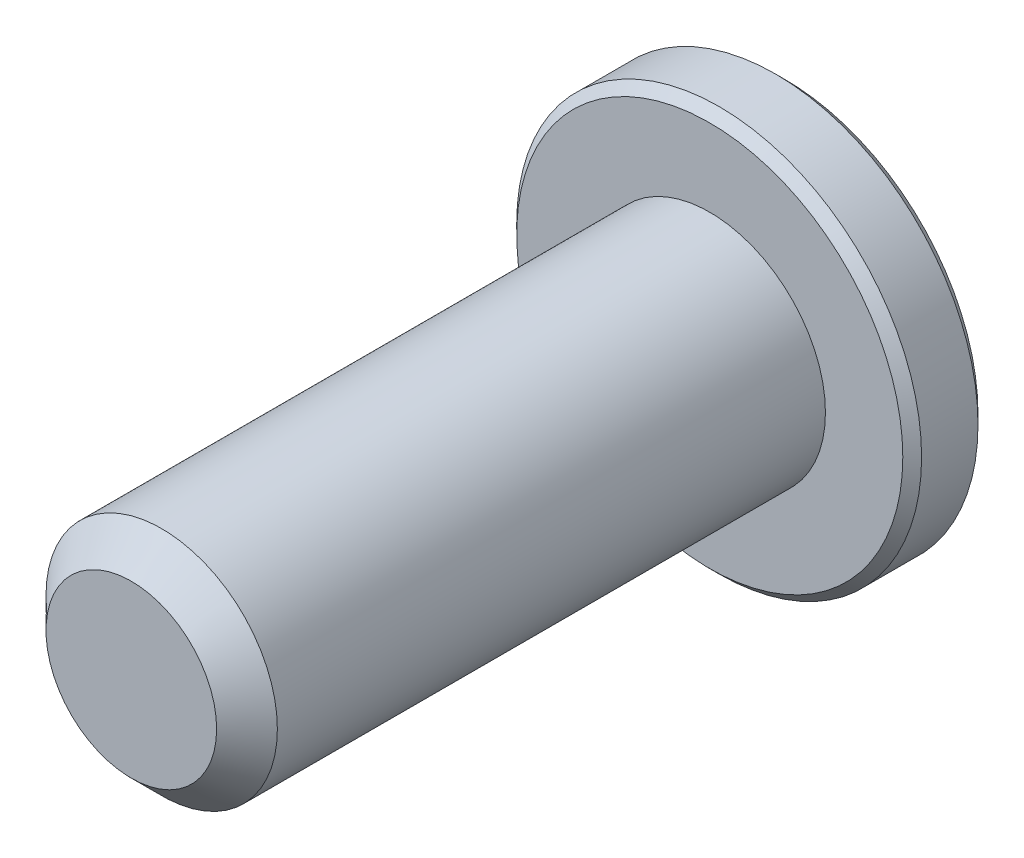
ISO-10303-21;
HEADER;
FILE_DESCRIPTION(('STEP AP214'),'2;1');
FILE_NAME('part.step','',(''),(''),'','','');
FILE_SCHEMA(('AUTOMOTIVE_DESIGN { 1 0 10303 214 1 1 1 1 }'));
ENDSEC;
DATA;
#1=APPLICATION_CONTEXT('core data for automotive mechanical design processes');
#2=APPLICATION_PROTOCOL_DEFINITION('international standard','automotive_design',2000,#1);
#3=PRODUCT_CONTEXT('',#1,'mechanical');
#4=PRODUCT('Part','Part','',(#3));
#5=PRODUCT_RELATED_PRODUCT_CATEGORY('part','',(#4));
#6=PRODUCT_DEFINITION_FORMATION('','',#4);
#7=PRODUCT_DEFINITION_CONTEXT('part definition',#1,'design');
#8=PRODUCT_DEFINITION('design','',#6,#7);
#9=PRODUCT_DEFINITION_SHAPE('','',#8);
#10=(LENGTH_UNIT() NAMED_UNIT(*) SI_UNIT(.MILLI.,.METRE.));
#11=(NAMED_UNIT(*) PLANE_ANGLE_UNIT() SI_UNIT($,.RADIAN.));
#12=(NAMED_UNIT(*) SI_UNIT($,.STERADIAN.) SOLID_ANGLE_UNIT());
#13=UNCERTAINTY_MEASURE_WITH_UNIT(LENGTH_MEASURE(1.E-05),#10,'distance_accuracy_value','');
#14=(GEOMETRIC_REPRESENTATION_CONTEXT(3) GLOBAL_UNCERTAINTY_ASSIGNED_CONTEXT((#13)) GLOBAL_UNIT_ASSIGNED_CONTEXT((#10,
#11,#12)) REPRESENTATION_CONTEXT('',''));
#15=CARTESIAN_POINT('',(0.,0.,0.));
#16=DIRECTION('',(0.,0.,1.));
#17=DIRECTION('',(1.,0.,0.));
#18=AXIS2_PLACEMENT_3D('',#15,#16,#17);
#19=CARTESIAN_POINT('',(0.,0.,-5.65));
#20=DIRECTION('',(0.,0.,1.));
#21=DIRECTION('',(1.,0.,0.));
#22=AXIS2_PLACEMENT_3D('',#19,#20,#21);
#23=PLANE('',#22);
#24=CARTESIAN_POINT('',(0.,0.,-5.65));
#25=DIRECTION('',(0.,0.,1.));
#26=DIRECTION('',(1.,0.,0.));
#27=AXIS2_PLACEMENT_3D('',#24,#25,#26);
#28=CIRCLE('',#27,3.3375);
#29=CARTESIAN_POINT('',(3.3375,0.,-5.65));
#30=VERTEX_POINT('',#29);
#31=EDGE_CURVE('E143',#30,#30,#28,.F.);
#32=ORIENTED_EDGE('',*,*,#31,.T.);
#33=EDGE_LOOP('',(#32));
#34=FACE_BOUND('',#33,.T.);
#35=CARTESIAN_POINT('',(0.,0.,-5.65));
#36=DIRECTION('',(0.,0.,1.));
#37=DIRECTION('',(1.,0.,0.));
#38=AXIS2_PLACEMENT_3D('',#35,#36,#37);
#39=CIRCLE('',#38,1.44337567297406);
#40=CARTESIAN_POINT('',(1.25,0.721687836487034,-5.65));
#41=VERTEX_POINT('',#40);
#42=CARTESIAN_POINT('',(0.,1.44337567297406,-5.65));
#43=VERTEX_POINT('',#42);
#44=EDGE_CURVE('E92',#41,#43,#39,.T.);
#45=ORIENTED_EDGE('',*,*,#44,.T.);
#46=CARTESIAN_POINT('',(0.,0.,-5.65));
#47=DIRECTION('',(0.,0.,1.));
#48=DIRECTION('',(1.,0.,0.));
#49=AXIS2_PLACEMENT_3D('',#46,#47,#48);
#50=CIRCLE('',#49,1.44337567297406);
#51=CARTESIAN_POINT('',(-1.25,0.721687836487028,-5.65));
#52=VERTEX_POINT('',#51);
#53=EDGE_CURVE('E103',#43,#52,#50,.T.);
#54=ORIENTED_EDGE('',*,*,#53,.T.);
#55=CARTESIAN_POINT('',(0.,0.,-5.65));
#56=DIRECTION('',(0.,0.,1.));
#57=DIRECTION('',(1.,0.,0.));
#58=AXIS2_PLACEMENT_3D('',#55,#56,#57);
#59=CIRCLE('',#58,1.44337567297406);
#60=CARTESIAN_POINT('',(-1.25,-0.721687836487028,-5.65));
#61=VERTEX_POINT('',#60);
#62=EDGE_CURVE('E121',#52,#61,#59,.T.);
#63=ORIENTED_EDGE('',*,*,#62,.T.);
#64=CARTESIAN_POINT('',(0.,0.,-5.65));
#65=DIRECTION('',(0.,0.,1.));
#66=DIRECTION('',(1.,0.,0.));
#67=AXIS2_PLACEMENT_3D('',#64,#65,#66);
#68=CIRCLE('',#67,1.44337567297406);
#69=CARTESIAN_POINT('',(0.,-1.44337567297406,-5.65));
#70=VERTEX_POINT('',#69);
#71=EDGE_CURVE('E387',#61,#70,#68,.T.);
#72=ORIENTED_EDGE('',*,*,#71,.T.);
#73=CARTESIAN_POINT('',(0.,0.,-5.65));
#74=DIRECTION('',(0.,0.,1.));
#75=DIRECTION('',(1.,0.,0.));
#76=AXIS2_PLACEMENT_3D('',#73,#74,#75);
#77=CIRCLE('',#76,1.44337567297406);
#78=CARTESIAN_POINT('',(1.25,-0.721687836487033,-5.65));
#79=VERTEX_POINT('',#78);
#80=EDGE_CURVE('E388',#70,#79,#77,.T.);
#81=ORIENTED_EDGE('',*,*,#80,.T.);
#82=CARTESIAN_POINT('',(0.,0.,-5.65));
#83=DIRECTION('',(0.,0.,1.));
#84=DIRECTION('',(1.,0.,0.));
#85=AXIS2_PLACEMENT_3D('',#82,#83,#84);
#86=CIRCLE('',#85,1.44337567297406);
#87=EDGE_CURVE('E106',#79,#41,#86,.T.);
#88=ORIENTED_EDGE('',*,*,#87,.T.);
#89=EDGE_LOOP('',(#45,#54,#63,#72,#81,#88));
#90=FACE_BOUND('',#89,.T.);
#91=ADVANCED_FACE('F34',(#34,#90),#23,.F.);
#92=CARTESIAN_POINT('',(1.25,0.721687836487033,-4.675));
#93=DIRECTION('',(-0.499999999999999,-0.866025403784439,0.));
#94=DIRECTION('',(0.866025403784439,-0.499999999999999,0.));
#95=AXIS2_PLACEMENT_3D('',#92,#93,#94);
#96=PLANE('',#95);
#97=DIRECTION('',(0.,0.,-1.));
#98=VECTOR('',#97,1.);
#99=CARTESIAN_POINT('',(0.,1.44337567297406,-4.675));
#100=LINE('',#99,#98);
#101=CARTESIAN_POINT('',(0.,1.44337567297406,-4.675));
#102=VERTEX_POINT('',#101);
#103=EDGE_CURVE('E118',#102,#43,#100,.T.);
#104=ORIENTED_EDGE('',*,*,#103,.T.);
#105=CARTESIAN_POINT('',(1.2502,0.721572366433195,-5.65011548390914));
#106=CARTESIAN_POINT('',(1.20722483292841,0.746384090710444,-5.62532166805511));
#107=CARTESIAN_POINT('',(1.16353099525405,0.771610739653665,-5.60198373441869));
#108=CARTESIAN_POINT('',(1.07443406915805,0.823050873919155,-5.55925200408454));
#109=CARTESIAN_POINT('',(1.02902250164293,0.849269254648333,-5.53988199236042));
#110=CARTESIAN_POINT('',(0.937452179064737,0.902137405038635,-5.50670048341348));
#111=CARTESIAN_POINT('',(0.891316759824111,0.928773701756387,-5.49280555905266));
#112=CARTESIAN_POINT('',(0.798029919592405,0.982632884076012,-5.47139728216064));
#113=CARTESIAN_POINT('',(0.750881350863617,1.00985412292348,-5.46386794156679));
#114=CARTESIAN_POINT('',(0.669626443112745,1.05676666578643,-5.45707449805071));
#115=CARTESIAN_POINT('',(0.635625123372056,1.07639733689152,-5.45606855910435));
#116=CARTESIAN_POINT('',(0.56768223556752,1.11562418145499,-5.45776141491132));
#117=CARTESIAN_POINT('',(0.53374068234434,1.1352203463451,-5.46046102721554));
#118=CARTESIAN_POINT('',(0.466185143542498,1.1742235548576,-5.46940893031638));
#119=CARTESIAN_POINT('',(0.432571492713223,1.19363040521232,-5.47566052589971));
#120=CARTESIAN_POINT('',(0.365905361782185,1.23212011385119,-5.49137568141391));
#121=CARTESIAN_POINT('',(0.332853128969702,1.25120282936279,-5.50084062008746));
#122=CARTESIAN_POINT('',(0.248200308399734,1.30007715810653,-5.52893139068759));
#123=CARTESIAN_POINT('',(0.19713350757036,1.32956058931202,-5.5496701574522));
#124=CARTESIAN_POINT('',(0.096999145886744,1.38737318998519,-5.59638713467148));
#125=CARTESIAN_POINT('',(0.0479256884217296,1.41570576386268,-5.62234829594677));
#126=CARTESIAN_POINT('',(-0.00020000000000083,1.4434911430279,-5.65011548390914));
#127=B_SPLINE_CURVE_WITH_KNOTS('',3,(#105,#106,#107,#108,#109,#110,#111,#112,#113,#114,#115,
#116,#117,#118,#119,#120,#121,#122,#123,#124,#125,#126),.UNSPECIFIED.,.F.,.F.,(4,2,2,2,2,2,2,2,
2,2,4),(0.,0.166533409618303,0.33403760728976,0.498880396489696,0.663307919240272,
0.780963963458824,0.89864597014845,1.01643764860773,1.13427993171549,1.3214865203214,
1.50809158792573),.UNSPECIFIED.);
#128=EDGE_CURVE('E89',#41,#43,#127,.T.);
#129=ORIENTED_EDGE('',*,*,#128,.F.);
#130=DIRECTION('',(0.,0.,-1.));
#131=VECTOR('',#130,1.);
#132=CARTESIAN_POINT('',(1.25,0.721687836487033,-4.675));
#133=LINE('',#132,#131);
#134=CARTESIAN_POINT('',(1.25,0.721687836487033,-4.675));
#135=VERTEX_POINT('',#134);
#136=EDGE_CURVE('E370',#135,#41,#133,.T.);
#137=ORIENTED_EDGE('',*,*,#136,.F.);
#138=DIRECTION('',(-0.866025403784439,0.499999999999999,0.));
#139=VECTOR('',#138,1.);
#140=CARTESIAN_POINT('',(1.25,0.721687836487033,-4.675));
#141=LINE('',#140,#139);
#142=EDGE_CURVE('E113',#135,#102,#141,.T.);
#143=ORIENTED_EDGE('',*,*,#142,.T.);
#144=EDGE_LOOP('',(#104,#129,#137,#143));
#145=FACE_BOUND('',#144,.T.);
#146=ADVANCED_FACE('F124',(#145),#96,.T.);
#147=CARTESIAN_POINT('',(1.25,-0.721687836487029,-4.675));
#148=DIRECTION('',(-1.,0.,0.));
#149=DIRECTION('',(0.,-1.,0.));
#150=AXIS2_PLACEMENT_3D('',#147,#148,#149);
#151=PLANE('',#150);
#152=ORIENTED_EDGE('',*,*,#136,.T.);
#153=CARTESIAN_POINT('',(1.25,-1.38992943348888,-6.07595678276481));
#154=CARTESIAN_POINT('',(1.25,-1.35585360144598,-6.05062384590546));
#155=CARTESIAN_POINT('',(1.25,-1.32158265708561,-6.0255540386235));
#156=CARTESIAN_POINT('',(1.25,-1.25257320054391,-5.97604777210552));
#157=CARTESIAN_POINT('',(1.25,-1.21783456799034,-5.95161148084676));
#158=CARTESIAN_POINT('',(1.25,-1.11229379200971,-5.87906617261387));
#159=CARTESIAN_POINT('',(1.25,-1.04068485708168,-5.83211103925946));
#160=CARTESIAN_POINT('',(1.25,-0.890834011639571,-5.74037081666435));
#161=CARTESIAN_POINT('',(1.25,-0.812441254075324,-5.69582917123014));
#162=CARTESIAN_POINT('',(1.25,-0.651805951733885,-5.61466295887272));
#163=CARTESIAN_POINT('',(1.25,-0.56957751460335,-5.57801179406796));
#164=CARTESIAN_POINT('',(1.25,-0.445666902783946,-5.53318878472561));
#165=CARTESIAN_POINT('',(1.25,-0.405715906756982,-5.52024564314349));
#166=CARTESIAN_POINT('',(1.25,-0.324892689132276,-5.49757378540961));
#167=CARTESIAN_POINT('',(1.25,-0.284020400151317,-5.48784530519787));
#168=CARTESIAN_POINT('',(1.25,-0.20225866246506,-5.47225763981377));
#169=CARTESIAN_POINT('',(1.25,-0.161381483064383,-5.46633507343161));
#170=CARTESIAN_POINT('',(1.25,-0.0792441307238299,-5.45846702132594));
#171=CARTESIAN_POINT('',(1.25,-0.0379840154943746,-5.45652094579608));
#172=CARTESIAN_POINT('',(1.25,0.0432341600364651,-5.45673289649202));
#173=CARTESIAN_POINT('',(1.25,0.0831926097530767,-5.45876454904398));
#174=CARTESIAN_POINT('',(1.25,0.16274644611995,-5.46655218105583));
#175=CARTESIAN_POINT('',(1.25,0.202341758544679,-5.47230890544306));
#176=CARTESIAN_POINT('',(1.25,0.28154631912982,-5.48733861417404));
#177=CARTESIAN_POINT('',(1.25,0.321144394728611,-5.49666962749469));
#178=CARTESIAN_POINT('',(1.25,0.399480919290786,-5.51836703523828));
#179=CARTESIAN_POINT('',(1.25,0.438219456017128,-5.53073311819671));
#180=CARTESIAN_POINT('',(1.25,0.562551887219005,-5.57501108328111));
#181=CARTESIAN_POINT('',(1.25,0.646311872820087,-5.61206181080177));
#182=CARTESIAN_POINT('',(1.25,0.809873231963306,-5.69436414583907));
#183=CARTESIAN_POINT('',(1.25,0.88965874213862,-5.73964571023902));
#184=CARTESIAN_POINT('',(1.25,1.04210036236046,-5.83298293010409));
#185=CARTESIAN_POINT('',(1.25,1.11491334005909,-5.88078550196313));
#186=CARTESIAN_POINT('',(1.25,1.22219009712169,-5.95464867004973));
#187=CARTESIAN_POINT('',(1.25,1.25748474843868,-5.97952350030935));
#188=CARTESIAN_POINT('',(1.25,1.32759376690005,-6.02992188471591));
#189=CARTESIAN_POINT('',(1.25,1.36240826213734,-6.05544526047357));
#190=CARTESIAN_POINT('',(1.25,1.3970231565127,-6.08123727369859));
#191=B_SPLINE_CURVE_WITH_KNOTS('',3,(#153,#154,#155,#156,#157,#158,#159,#160,#161,#162,#163,
#164,#165,#166,#167,#168,#169,#170,#171,#172,#173,#174,#175,#176,#177,#178,#179,#180,#181,#182,
#183,#184,#185,#186,#187,#188,#189,#190),.UNSPECIFIED.,.F.,.F.,(4,2,2,2,2,2,2,2,2,2,2,2,2,2,2,2,
2,2,4),(0.,0.127379033817002,0.254791503830238,0.51156114040546,0.781814668857772,
1.05114242314894,1.17702064742503,1.30290810848098,1.42664072359053,1.55035498493452,
1.67020252454504,1.7900740382739,1.91198034452075,2.03387414574236,2.30782771694623,
2.58279909340041,2.84397769429347,2.97351138093345,3.10300981562539),.UNSPECIFIED.);
#192=EDGE_CURVE('E96',#79,#41,#191,.T.);
#193=ORIENTED_EDGE('',*,*,#192,.F.);
#194=DIRECTION('',(0.,0.,-1.));
#195=VECTOR('',#194,1.);
#196=CARTESIAN_POINT('',(1.25,-0.721687836487029,-4.675));
#197=LINE('',#196,#195);
#198=CARTESIAN_POINT('',(1.25,-0.721687836487029,-4.675));
#199=VERTEX_POINT('',#198);
#200=EDGE_CURVE('E372',#199,#79,#197,.T.);
#201=ORIENTED_EDGE('',*,*,#200,.F.);
#202=DIRECTION('',(0.,1.,0.));
#203=VECTOR('',#202,1.);
#204=CARTESIAN_POINT('',(1.25,-0.721687836487029,-4.675));
#205=LINE('',#204,#203);
#206=EDGE_CURVE('E49',#199,#135,#205,.T.);
#207=ORIENTED_EDGE('',*,*,#206,.T.);
#208=EDGE_LOOP('',(#152,#193,#201,#207));
#209=FACE_BOUND('',#208,.T.);
#210=ADVANCED_FACE('F165',(#209),#151,.T.);
#211=CARTESIAN_POINT('',(0.,-1.44337567297406,-4.675));
#212=DIRECTION('',(-0.500000000000001,0.866025403784438,0.));
#213=DIRECTION('',(-0.866025403784438,-0.500000000000001,0.));
#214=AXIS2_PLACEMENT_3D('',#211,#212,#213);
#215=PLANE('',#214);
#216=ORIENTED_EDGE('',*,*,#200,.T.);
#217=CARTESIAN_POINT('',(-0.000199999999998916,-1.4434911430279,-5.65011548390914));
#218=CARTESIAN_POINT('',(0.0427751670715877,-1.41867941875065,-5.6253216680551));
#219=CARTESIAN_POINT('',(0.0864690047459489,-1.39345276980743,-5.60198373441868));
#220=CARTESIAN_POINT('',(0.175565930841942,-1.34201263554194,-5.55925200408454));
#221=CARTESIAN_POINT('',(0.220977498357064,-1.31579425481276,-5.53988199236041));
#222=CARTESIAN_POINT('',(0.31254782093526,-1.26292610442246,-5.50670048341348));
#223=CARTESIAN_POINT('',(0.358683240175885,-1.23628980770471,-5.49280555905266));
#224=CARTESIAN_POINT('',(0.451970080407592,-1.18243062538508,-5.47139728216064));
#225=CARTESIAN_POINT('',(0.499118649136379,-1.15520938653761,-5.46386794156679));
#226=CARTESIAN_POINT('',(0.580373556887251,-1.10829684367466,-5.4570744980507));
#227=CARTESIAN_POINT('',(0.61437487662794,-1.08866617256958,-5.45606855910435));
#228=CARTESIAN_POINT('',(0.682317764432476,-1.04943932800611,-5.45776141491132));
#229=CARTESIAN_POINT('',(0.716259317655656,-1.02984316311599,-5.46046102721554));
#230=CARTESIAN_POINT('',(0.783814856457498,-0.990839954603495,-5.46940893031638));
#231=CARTESIAN_POINT('',(0.817428507286773,-0.971433104248767,-5.47566052589971));
#232=CARTESIAN_POINT('',(0.884094638217811,-0.932943395609901,-5.49137568141391));
#233=CARTESIAN_POINT('',(0.917146871030293,-0.913860680098297,-5.50084062008746));
#234=CARTESIAN_POINT('',(1.00179969160026,-0.864986351354564,-5.52893139068759));
#235=CARTESIAN_POINT('',(1.05286649242963,-0.835502920149072,-5.5496701574522));
#236=CARTESIAN_POINT('',(1.15300085411325,-0.777690319475905,-5.59638713467148));
#237=CARTESIAN_POINT('',(1.20207431157827,-0.749357745598413,-5.62234829594677));
#238=CARTESIAN_POINT('',(1.2502,-0.721572366433191,-5.65011548390914));
#239=B_SPLINE_CURVE_WITH_KNOTS('',3,(#217,#218,#219,#220,#221,#222,#223,#224,#225,#226,#227,
#228,#229,#230,#231,#232,#233,#234,#235,#236,#237,#238),.UNSPECIFIED.,.F.,.F.,(4,2,2,2,2,2,2,2,
2,2,4),(0.,0.166533409618303,0.33403760728976,0.498880396489697,0.663307919240272,
0.780963963458824,0.89864597014845,1.01643764860773,1.13427993171549,1.3214865203214,
1.50809158792573),.UNSPECIFIED.);
#240=EDGE_CURVE('E410',#70,#79,#239,.T.);
#241=ORIENTED_EDGE('',*,*,#240,.F.);
#242=DIRECTION('',(0.,0.,-1.));
#243=VECTOR('',#242,1.);
#244=CARTESIAN_POINT('',(0.,-1.44337567297406,-4.675));
#245=LINE('',#244,#243);
#246=CARTESIAN_POINT('',(0.,-1.44337567297406,-4.675));
#247=VERTEX_POINT('',#246);
#248=EDGE_CURVE('E374',#247,#70,#245,.T.);
#249=ORIENTED_EDGE('',*,*,#248,.F.);
#250=DIRECTION('',(0.866025403784438,0.500000000000001,0.));
#251=VECTOR('',#250,1.);
#252=CARTESIAN_POINT('',(0.,-1.44337567297406,-4.675));
#253=LINE('',#252,#251);
#254=EDGE_CURVE('E57',#247,#199,#253,.T.);
#255=ORIENTED_EDGE('',*,*,#254,.T.);
#256=EDGE_LOOP('',(#216,#241,#249,#255));
#257=FACE_BOUND('',#256,.T.);
#258=ADVANCED_FACE('F283',(#257),#215,.T.);
#259=CARTESIAN_POINT('',(-1.25,-0.721687836487029,-4.675));
#260=DIRECTION('',(0.5,0.866025403784439,0.));
#261=DIRECTION('',(-0.866025403784439,0.5,0.));
#262=AXIS2_PLACEMENT_3D('',#259,#260,#261);
#263=PLANE('',#262);
#264=ORIENTED_EDGE('',*,*,#248,.T.);
#265=CARTESIAN_POINT('',(-1.2502,-0.721572366433191,-5.65011548390914));
#266=CARTESIAN_POINT('',(-1.20722483292841,-0.74638409071044,-5.62532166805511));
#267=CARTESIAN_POINT('',(-1.16353099525405,-0.771610739653661,-5.60198373441869));
#268=CARTESIAN_POINT('',(-1.07443406915806,-0.823050873919151,-5.55925200408454));
#269=CARTESIAN_POINT('',(-1.02902250164293,-0.849269254648329,-5.53988199236041));
#270=CARTESIAN_POINT('',(-0.937452179064738,-0.902137405038632,-5.50670048341348));
#271=CARTESIAN_POINT('',(-0.891316759824112,-0.928773701756383,-5.49280555905266));
#272=CARTESIAN_POINT('',(-0.798029919592405,-0.982632884076009,-5.47139728216064));
#273=CARTESIAN_POINT('',(-0.750881350863618,-1.00985412292348,-5.46386794156679));
#274=CARTESIAN_POINT('',(-0.669626443112746,-1.05676666578642,-5.4570744980507));
#275=CARTESIAN_POINT('',(-0.635625123372057,-1.07639733689151,-5.45606855910435));
#276=CARTESIAN_POINT('',(-0.567682235567521,-1.11562418145498,-5.45776141491132));
#277=CARTESIAN_POINT('',(-0.533740682344341,-1.1352203463451,-5.46046102721554));
#278=CARTESIAN_POINT('',(-0.466185143542499,-1.17422355485759,-5.46940893031638));
#279=CARTESIAN_POINT('',(-0.432571492713224,-1.19363040521232,-5.47566052589971));
#280=CARTESIAN_POINT('',(-0.365905361782186,-1.23212011385119,-5.4913756814139));
#281=CARTESIAN_POINT('',(-0.332853128969703,-1.25120282936279,-5.50084062008746));
#282=CARTESIAN_POINT('',(-0.248200308399735,-1.30007715810652,-5.52893139068759));
#283=CARTESIAN_POINT('',(-0.197133507570361,-1.32956058931202,-5.5496701574522));
#284=CARTESIAN_POINT('',(-0.0969991458867445,-1.38737318998518,-5.59638713467148));
#285=CARTESIAN_POINT('',(-0.0479256884217299,-1.41570576386268,-5.62234829594677));
#286=CARTESIAN_POINT('',(0.000200000000000811,-1.4434911430279,-5.65011548390914));
#287=B_SPLINE_CURVE_WITH_KNOTS('',3,(#265,#266,#267,#268,#269,#270,#271,#272,#273,#274,#275,
#276,#277,#278,#279,#280,#281,#282,#283,#284,#285,#286),.UNSPECIFIED.,.F.,.F.,(4,2,2,2,2,2,2,2,
2,2,4),(0.,0.166533409618304,0.334037607289762,0.498880396489699,0.663307919240275,
0.780963963458827,0.898645970148453,1.01643764860773,1.13427993171549,1.32148652032141,
1.50809158792573),.UNSPECIFIED.);
#288=EDGE_CURVE('E385',#61,#70,#287,.T.);
#289=ORIENTED_EDGE('',*,*,#288,.F.);
#290=DIRECTION('',(0.,0.,-1.));
#291=VECTOR('',#290,1.);
#292=CARTESIAN_POINT('',(-1.25,-0.721687836487029,-4.675));
#293=LINE('',#292,#291);
#294=CARTESIAN_POINT('',(-1.25,-0.721687836487029,-4.675));
#295=VERTEX_POINT('',#294);
#296=EDGE_CURVE('E131',#295,#61,#293,.T.);
#297=ORIENTED_EDGE('',*,*,#296,.F.);
#298=DIRECTION('',(0.866025403784439,-0.5,0.));
#299=VECTOR('',#298,1.);
#300=CARTESIAN_POINT('',(-1.25,-0.721687836487029,-4.675));
#301=LINE('',#300,#299);
#302=EDGE_CURVE('E366',#295,#247,#301,.T.);
#303=ORIENTED_EDGE('',*,*,#302,.T.);
#304=EDGE_LOOP('',(#264,#289,#297,#303));
#305=FACE_BOUND('',#304,.T.);
#306=ADVANCED_FACE('F291',(#305),#263,.T.);
#307=CARTESIAN_POINT('',(-1.25,0.721687836487031,-4.675));
#308=DIRECTION('',(1.,0.,0.));
#309=DIRECTION('',(0.,1.,0.));
#310=AXIS2_PLACEMENT_3D('',#307,#308,#309);
#311=PLANE('',#310);
#312=ORIENTED_EDGE('',*,*,#296,.T.);
#313=CARTESIAN_POINT('',(-1.25,-1.38992943348888,-6.07595678276481));
#314=CARTESIAN_POINT('',(-1.25,-1.35585360144598,-6.05062384590546));
#315=CARTESIAN_POINT('',(-1.25,-1.32158265708561,-6.0255540386235));
#316=CARTESIAN_POINT('',(-1.25,-1.25257320054391,-5.97604777210552));
#317=CARTESIAN_POINT('',(-1.25,-1.21783456799034,-5.95161148084676));
#318=CARTESIAN_POINT('',(-1.25,-1.11229379200971,-5.87906617261387));
#319=CARTESIAN_POINT('',(-1.25,-1.04068485708168,-5.83211103925946));
#320=CARTESIAN_POINT('',(-1.25,-0.890834011639569,-5.74037081666435));
#321=CARTESIAN_POINT('',(-1.25,-0.812441254075323,-5.69582917123015));
#322=CARTESIAN_POINT('',(-1.25,-0.651805951733885,-5.61466295887273));
#323=CARTESIAN_POINT('',(-1.25,-0.569577514603349,-5.57801179406797));
#324=CARTESIAN_POINT('',(-1.25,-0.445666902783945,-5.53318878472562));
#325=CARTESIAN_POINT('',(-1.25,-0.405715906756981,-5.5202456431435));
#326=CARTESIAN_POINT('',(-1.25,-0.324892689132275,-5.49757378540961));
#327=CARTESIAN_POINT('',(-1.25,-0.284020400151316,-5.48784530519787));
#328=CARTESIAN_POINT('',(-1.25,-0.20225866246506,-5.47225763981378));
#329=CARTESIAN_POINT('',(-1.25,-0.161381483064383,-5.46633507343162));
#330=CARTESIAN_POINT('',(-1.25,-0.0792441307238293,-5.45846702132595));
#331=CARTESIAN_POINT('',(-1.25,-0.0379840154943741,-5.45652094579608));
#332=CARTESIAN_POINT('',(-1.25,0.0432341600364656,-5.45673289649202));
#333=CARTESIAN_POINT('',(-1.25,0.0831926097530772,-5.45876454904399));
#334=CARTESIAN_POINT('',(-1.25,0.16274644611995,-5.46655218105583));
#335=CARTESIAN_POINT('',(-1.25,0.202341758544679,-5.47230890544306));
#336=CARTESIAN_POINT('',(-1.25,0.28154631912982,-5.48733861417404));
#337=CARTESIAN_POINT('',(-1.25,0.321144394728612,-5.4966696274947));
#338=CARTESIAN_POINT('',(-1.25,0.399480919290786,-5.51836703523828));
#339=CARTESIAN_POINT('',(-1.25,0.438219456017128,-5.53073311819672));
#340=CARTESIAN_POINT('',(-1.25,0.562551887219005,-5.57501108328111));
#341=CARTESIAN_POINT('',(-1.25,0.646311872820088,-5.61206181080177));
#342=CARTESIAN_POINT('',(-1.25,0.809873231963307,-5.69436414583907));
#343=CARTESIAN_POINT('',(-1.25,0.889658742138622,-5.73964571023902));
#344=CARTESIAN_POINT('',(-1.25,1.04210036236046,-5.83298293010409));
#345=CARTESIAN_POINT('',(-1.25,1.11491334005909,-5.88078550196313));
#346=CARTESIAN_POINT('',(-1.25,1.22219009712169,-5.95464867004973));
#347=CARTESIAN_POINT('',(-1.25,1.25748474843869,-5.97952350030935));
#348=CARTESIAN_POINT('',(-1.25,1.32759376690005,-6.02992188471591));
#349=CARTESIAN_POINT('',(-1.25,1.36240826213734,-6.05544526047358));
#350=CARTESIAN_POINT('',(-1.25,1.3970231565127,-6.08123727369859));
#351=B_SPLINE_CURVE_WITH_KNOTS('',3,(#313,#314,#315,#316,#317,#318,#319,#320,#321,#322,#323,
#324,#325,#326,#327,#328,#329,#330,#331,#332,#333,#334,#335,#336,#337,#338,#339,#340,#341,#342,
#343,#344,#345,#346,#347,#348,#349,#350),.UNSPECIFIED.,.F.,.F.,(4,2,2,2,2,2,2,2,2,2,2,2,2,2,2,2,
2,2,4),(0.,0.127379033817001,0.254791503830238,0.511561140405459,0.781814668857769,
1.05114242314894,1.17702064742503,1.30290810848098,1.42664072359053,1.55035498493451,
1.67020252454504,1.7900740382739,1.91198034452075,2.03387414574236,2.30782771694622,
2.58279909340041,2.84397769429347,2.97351138093345,3.10300981562539),.UNSPECIFIED.);
#352=EDGE_CURVE('E380',#52,#61,#351,.F.);
#353=ORIENTED_EDGE('',*,*,#352,.F.);
#354=DIRECTION('',(0.,0.,-1.));
#355=VECTOR('',#354,1.);
#356=CARTESIAN_POINT('',(-1.25,0.721687836487031,-4.675));
#357=LINE('',#356,#355);
#358=CARTESIAN_POINT('',(-1.25,0.721687836487031,-4.675));
#359=VERTEX_POINT('',#358);
#360=EDGE_CURVE('E120',#359,#52,#357,.T.);
#361=ORIENTED_EDGE('',*,*,#360,.F.);
#362=DIRECTION('',(0.,-1.,0.));
#363=VECTOR('',#362,1.);
#364=CARTESIAN_POINT('',(-1.25,0.721687836487031,-4.675));
#365=LINE('',#364,#363);
#366=EDGE_CURVE('E364',#359,#295,#365,.T.);
#367=ORIENTED_EDGE('',*,*,#366,.T.);
#368=EDGE_LOOP('',(#312,#353,#361,#367));
#369=FACE_BOUND('',#368,.T.);
#370=ADVANCED_FACE('F299',(#369),#311,.T.);
#371=CARTESIAN_POINT('',(0.,1.44337567297406,-4.675));
#372=DIRECTION('',(0.5,-0.866025403784439,0.));
#373=DIRECTION('',(0.866025403784439,0.5,0.));
#374=AXIS2_PLACEMENT_3D('',#371,#372,#373);
#375=PLANE('',#374);
#376=ORIENTED_EDGE('',*,*,#360,.T.);
#377=CARTESIAN_POINT('',(0.000199999999999134,1.4434911430279,-5.65011548390914));
#378=CARTESIAN_POINT('',(-0.0427751670715875,1.41867941875065,-5.62532166805511));
#379=CARTESIAN_POINT('',(-0.0864690047459486,1.39345276980743,-5.60198373441869));
#380=CARTESIAN_POINT('',(-0.175565930841942,1.34201263554194,-5.55925200408454));
#381=CARTESIAN_POINT('',(-0.220977498357064,1.31579425481276,-5.53988199236042));
#382=CARTESIAN_POINT('',(-0.312547820935259,1.26292610442246,-5.50670048341348));
#383=CARTESIAN_POINT('',(-0.358683240175885,1.23628980770471,-5.49280555905266));
#384=CARTESIAN_POINT('',(-0.451970080407591,1.18243062538508,-5.47139728216064));
#385=CARTESIAN_POINT('',(-0.499118649136378,1.15520938653761,-5.46386794156679));
#386=CARTESIAN_POINT('',(-0.58037355688725,1.10829684367467,-5.45707449805071));
#387=CARTESIAN_POINT('',(-0.614374876627939,1.08866617256958,-5.45606855910435));
#388=CARTESIAN_POINT('',(-0.682317764432475,1.04943932800611,-5.45776141491132));
#389=CARTESIAN_POINT('',(-0.716259317655655,1.02984316311599,-5.46046102721554));
#390=CARTESIAN_POINT('',(-0.783814856457497,0.990839954603498,-5.46940893031638));
#391=CARTESIAN_POINT('',(-0.817428507286772,0.97143310424877,-5.47566052589971));
#392=CARTESIAN_POINT('',(-0.88409463821781,0.932943395609905,-5.49137568141391));
#393=CARTESIAN_POINT('',(-0.917146871030293,0.9138606800983,-5.50084062008746));
#394=CARTESIAN_POINT('',(-1.00179969160026,0.864986351354567,-5.52893139068759));
#395=CARTESIAN_POINT('',(-1.05286649242964,0.835502920149075,-5.5496701574522));
#396=CARTESIAN_POINT('',(-1.15300085411325,0.777690319475908,-5.59638713467148));
#397=CARTESIAN_POINT('',(-1.20207431157827,0.749357745598416,-5.62234829594677));
#398=CARTESIAN_POINT('',(-1.2502,0.721572366433193,-5.65011548390914));
#399=B_SPLINE_CURVE_WITH_KNOTS('',3,(#377,#378,#379,#380,#381,#382,#383,#384,#385,#386,#387,
#388,#389,#390,#391,#392,#393,#394,#395,#396,#397,#398),.UNSPECIFIED.,.F.,.F.,(4,2,2,2,2,2,2,2,
2,2,4),(0.,0.166533409618303,0.33403760728976,0.498880396489695,0.663307919240271,
0.780963963458823,0.898645970148449,1.01643764860773,1.13427993171549,1.3214865203214,
1.50809158792573),.UNSPECIFIED.);
#400=EDGE_CURVE('E112',#43,#52,#399,.T.);
#401=ORIENTED_EDGE('',*,*,#400,.F.);
#402=ORIENTED_EDGE('',*,*,#103,.F.);
#403=DIRECTION('',(-0.866025403784439,-0.5,0.));
#404=VECTOR('',#403,1.);
#405=CARTESIAN_POINT('',(0.,1.44337567297406,-4.675));
#406=LINE('',#405,#404);
#407=EDGE_CURVE('E362',#102,#359,#406,.T.);
#408=ORIENTED_EDGE('',*,*,#407,.T.);
#409=EDGE_LOOP('',(#376,#401,#402,#408));
#410=FACE_BOUND('',#409,.T.);
#411=ADVANCED_FACE('F117',(#410),#375,.T.);
#412=CARTESIAN_POINT('',(0.,0.,5.65));
#413=DIRECTION('',(0.,0.,-1.));
#414=DIRECTION('',(-1.,0.,0.));
#415=AXIS2_PLACEMENT_3D('',#412,#413,#414);
#416=CYLINDRICAL_SURFACE('',#415,2.);
#417=CARTESIAN_POINT('',(0.,0.,5.125));
#418=DIRECTION('',(0.,0.,1.));
#419=DIRECTION('',(1.,0.,0.));
#420=AXIS2_PLACEMENT_3D('',#417,#418,#419);
#421=CIRCLE('',#420,2.);
#422=CARTESIAN_POINT('',(2.,0.,5.125));
#423=VERTEX_POINT('',#422);
#424=EDGE_CURVE('E11',#423,#423,#421,.F.);
#425=ORIENTED_EDGE('',*,*,#424,.T.);
#426=EDGE_LOOP('',(#425));
#427=FACE_BOUND('',#426,.T.);
#428=CARTESIAN_POINT('',(0.,0.,-4.35));
#429=DIRECTION('',(0.,0.,1.));
#430=DIRECTION('',(1.,0.,0.));
#431=AXIS2_PLACEMENT_3D('',#428,#429,#430);
#432=CIRCLE('',#431,2.);
#433=CARTESIAN_POINT('',(2.,0.,-4.35));
#434=VERTEX_POINT('',#433);
#435=EDGE_CURVE('E126',#434,#434,#432,.T.);
#436=ORIENTED_EDGE('',*,*,#435,.T.);
#437=EDGE_LOOP('',(#436));
#438=FACE_BOUND('',#437,.T.);
#439=ADVANCED_FACE('F177',(#427,#438),#416,.T.);
#440=CARTESIAN_POINT('',(0.,0.,5.65));
#441=DIRECTION('',(0.,0.,1.));
#442=DIRECTION('',(1.,0.,0.));
#443=AXIS2_PLACEMENT_3D('',#440,#441,#442);
#444=PLANE('',#443);
#445=CARTESIAN_POINT('',(0.,0.,5.65));
#446=DIRECTION('',(0.,0.,1.));
#447=DIRECTION('',(1.,0.,0.));
#448=AXIS2_PLACEMENT_3D('',#445,#446,#447);
#449=CIRCLE('',#448,1.475);
#450=CARTESIAN_POINT('',(1.475,0.,5.65));
#451=VERTEX_POINT('',#450);
#452=EDGE_CURVE('E42',#451,#451,#449,.T.);
#453=ORIENTED_EDGE('',*,*,#452,.T.);
#454=EDGE_LOOP('',(#453));
#455=FACE_BOUND('',#454,.T.);
#456=ADVANCED_FACE('F148',(#455),#444,.T.);
#457=CARTESIAN_POINT('',(0.,0.,-4.35));
#458=DIRECTION('',(0.,0.,1.));
#459=DIRECTION('',(1.,0.,0.));
#460=AXIS2_PLACEMENT_3D('',#457,#458,#459);
#461=PLANE('',#460);
#462=CARTESIAN_POINT('',(0.,0.,-4.35));
#463=DIRECTION('',(0.,0.,1.));
#464=DIRECTION('',(1.,0.,0.));
#465=AXIS2_PLACEMENT_3D('',#462,#463,#464);
#466=CIRCLE('',#465,3.3375);
#467=CARTESIAN_POINT('',(3.3375,0.,-4.35));
#468=VERTEX_POINT('',#467);
#469=EDGE_CURVE('E129',#468,#468,#466,.T.);
#470=ORIENTED_EDGE('',*,*,#469,.T.);
#471=EDGE_LOOP('',(#470));
#472=FACE_BOUND('',#471,.T.);
#473=ORIENTED_EDGE('',*,*,#435,.F.);
#474=EDGE_LOOP('',(#473));
#475=FACE_BOUND('',#474,.T.);
#476=ADVANCED_FACE('F169',(#472,#475),#461,.T.);
#477=CARTESIAN_POINT('',(0.,0.,-4.35));
#478=DIRECTION('',(0.,0.,-1.));
#479=DIRECTION('',(-1.,0.,0.));
#480=AXIS2_PLACEMENT_3D('',#477,#478,#479);
#481=CYLINDRICAL_SURFACE('',#480,3.5);
#482=CARTESIAN_POINT('',(0.,0.,-4.5125));
#483=DIRECTION('',(0.,0.,1.));
#484=DIRECTION('',(1.,0.,0.));
#485=AXIS2_PLACEMENT_3D('',#482,#483,#484);
#486=CIRCLE('',#485,3.5);
#487=CARTESIAN_POINT('',(3.5,0.,-4.5125));
#488=VERTEX_POINT('',#487);
#489=EDGE_CURVE('E140',#488,#488,#486,.F.);
#490=ORIENTED_EDGE('',*,*,#489,.T.);
#491=EDGE_LOOP('',(#490));
#492=FACE_BOUND('',#491,.T.);
#493=CARTESIAN_POINT('',(0.,0.,-5.4875));
#494=DIRECTION('',(0.,0.,1.));
#495=DIRECTION('',(1.,0.,0.));
#496=AXIS2_PLACEMENT_3D('',#493,#494,#495);
#497=CIRCLE('',#496,3.5);
#498=CARTESIAN_POINT('',(3.5,0.,-5.4875));
#499=VERTEX_POINT('',#498);
#500=EDGE_CURVE('E137',#499,#499,#497,.T.);
#501=ORIENTED_EDGE('',*,*,#500,.T.);
#502=EDGE_LOOP('',(#501));
#503=FACE_BOUND('',#502,.T.);
#504=ADVANCED_FACE('F170',(#492,#503),#481,.T.);
#505=CARTESIAN_POINT('',(1.25,0.721687836487033,-4.675));
#506=DIRECTION('',(0.,0.,-1.));
#507=DIRECTION('',(-1.,0.,0.));
#508=AXIS2_PLACEMENT_3D('',#505,#506,#507);
#509=PLANE('',#508);
#510=ORIENTED_EDGE('',*,*,#142,.F.);
#511=ORIENTED_EDGE('',*,*,#206,.F.);
#512=ORIENTED_EDGE('',*,*,#254,.F.);
#513=ORIENTED_EDGE('',*,*,#302,.F.);
#514=ORIENTED_EDGE('',*,*,#366,.F.);
#515=ORIENTED_EDGE('',*,*,#407,.F.);
#516=EDGE_LOOP('',(#510,#511,#512,#513,#514,#515));
#517=FACE_BOUND('',#516,.T.);
#518=ADVANCED_FACE('F173',(#517),#509,.T.);
#519=CARTESIAN_POINT('',(0.,0.,-5.65));
#520=DIRECTION('',(0.,0.,-1.));
#521=DIRECTION('',(1.,0.,0.));
#522=AXIS2_PLACEMENT_3D('',#519,#520,#521);
#523=CONICAL_SURFACE('',#522,1.44337567297406,0.78539816339745);
#524=ORIENTED_EDGE('',*,*,#400,.T.);
#525=ORIENTED_EDGE('',*,*,#53,.F.);
#526=EDGE_LOOP('',(#524,#525));
#527=FACE_BOUND('',#526,.T.);
#528=ADVANCED_FACE('F111',(#527),#523,.F.);
#529=CARTESIAN_POINT('',(0.,0.,-5.65));
#530=DIRECTION('',(0.,0.,-1.));
#531=DIRECTION('',(1.,0.,0.));
#532=AXIS2_PLACEMENT_3D('',#529,#530,#531);
#533=CONICAL_SURFACE('',#532,1.44337567297406,0.78539816339745);
#534=ORIENTED_EDGE('',*,*,#352,.T.);
#535=ORIENTED_EDGE('',*,*,#62,.F.);
#536=EDGE_LOOP('',(#534,#535));
#537=FACE_BOUND('',#536,.T.);
#538=ADVANCED_FACE('F218',(#537),#533,.F.);
#539=CARTESIAN_POINT('',(0.,0.,-5.65));
#540=DIRECTION('',(0.,0.,-1.));
#541=DIRECTION('',(1.,0.,0.));
#542=AXIS2_PLACEMENT_3D('',#539,#540,#541);
#543=CONICAL_SURFACE('',#542,1.44337567297406,0.78539816339745);
#544=ORIENTED_EDGE('',*,*,#288,.T.);
#545=ORIENTED_EDGE('',*,*,#71,.F.);
#546=EDGE_LOOP('',(#544,#545));
#547=FACE_BOUND('',#546,.T.);
#548=ADVANCED_FACE('F226',(#547),#543,.F.);
#549=CARTESIAN_POINT('',(0.,0.,-5.65));
#550=DIRECTION('',(0.,0.,-1.));
#551=DIRECTION('',(1.,0.,0.));
#552=AXIS2_PLACEMENT_3D('',#549,#550,#551);
#553=CONICAL_SURFACE('',#552,1.44337567297406,0.78539816339745);
#554=ORIENTED_EDGE('',*,*,#240,.T.);
#555=ORIENTED_EDGE('',*,*,#80,.F.);
#556=EDGE_LOOP('',(#554,#555));
#557=FACE_BOUND('',#556,.T.);
#558=ADVANCED_FACE('F234',(#557),#553,.F.);
#559=CARTESIAN_POINT('',(0.,0.,-5.65));
#560=DIRECTION('',(0.,0.,-1.));
#561=DIRECTION('',(1.,0.,0.));
#562=AXIS2_PLACEMENT_3D('',#559,#560,#561);
#563=CONICAL_SURFACE('',#562,1.44337567297406,0.78539816339745);
#564=ORIENTED_EDGE('',*,*,#192,.T.);
#565=ORIENTED_EDGE('',*,*,#87,.F.);
#566=EDGE_LOOP('',(#564,#565));
#567=FACE_BOUND('',#566,.T.);
#568=ADVANCED_FACE('F186',(#567),#563,.F.);
#569=CARTESIAN_POINT('',(0.,0.,-5.65));
#570=DIRECTION('',(0.,0.,-1.));
#571=DIRECTION('',(1.,0.,0.));
#572=AXIS2_PLACEMENT_3D('',#569,#570,#571);
#573=CONICAL_SURFACE('',#572,1.44337567297406,0.78539816339745);
#574=ORIENTED_EDGE('',*,*,#128,.T.);
#575=ORIENTED_EDGE('',*,*,#44,.F.);
#576=EDGE_LOOP('',(#574,#575));
#577=FACE_BOUND('',#576,.T.);
#578=ADVANCED_FACE('F91',(#577),#573,.F.);
#579=CARTESIAN_POINT('',(0.,0.,-4.35));
#580=DIRECTION('',(0.,0.,-1.));
#581=DIRECTION('',(-1.,0.,0.));
#582=AXIS2_PLACEMENT_3D('',#579,#580,#581);
#583=CONICAL_SURFACE('',#582,3.3375,0.785398163397452);
#584=ORIENTED_EDGE('',*,*,#489,.F.);
#585=EDGE_LOOP('',(#584));
#586=FACE_BOUND('',#585,.T.);
#587=ORIENTED_EDGE('',*,*,#469,.F.);
#588=EDGE_LOOP('',(#587));
#589=FACE_BOUND('',#588,.T.);
#590=ADVANCED_FACE('F156',(#586,#589),#583,.T.);
#591=CARTESIAN_POINT('',(0.,0.,-5.4875));
#592=DIRECTION('',(0.,0.,1.));
#593=DIRECTION('',(1.,0.,0.));
#594=AXIS2_PLACEMENT_3D('',#591,#592,#593);
#595=CONICAL_SURFACE('',#594,3.5,0.78539816339745);
#596=ORIENTED_EDGE('',*,*,#31,.F.);
#597=EDGE_LOOP('',(#596));
#598=FACE_BOUND('',#597,.T.);
#599=ORIENTED_EDGE('',*,*,#500,.F.);
#600=EDGE_LOOP('',(#599));
#601=FACE_BOUND('',#600,.T.);
#602=ADVANCED_FACE('F151',(#598,#601),#595,.T.);
#603=CARTESIAN_POINT('',(0.,0.,5.65));
#604=DIRECTION('',(0.,0.,-1.));
#605=DIRECTION('',(-1.,0.,0.));
#606=AXIS2_PLACEMENT_3D('',#603,#604,#605);
#607=CONICAL_SURFACE('',#606,1.475,0.785398163397447);
#608=ORIENTED_EDGE('',*,*,#424,.F.);
#609=EDGE_LOOP('',(#608));
#610=FACE_BOUND('',#609,.T.);
#611=ORIENTED_EDGE('',*,*,#452,.F.);
#612=EDGE_LOOP('',(#611));
#613=FACE_BOUND('',#612,.T.);
#614=ADVANCED_FACE('F36',(#610,#613),#607,.T.);
#615=CLOSED_SHELL('',(#91,#146,#210,#258,#306,#370,#411,#439,#456,#476,#504,#518,#528,#538,#548,
#558,#568,#578,#590,#602,#614));
#616=MANIFOLD_SOLID_BREP('B2',#615);
#617=ADVANCED_BREP_SHAPE_REPRESENTATION('',(#18,#616),#14);
#618=SHAPE_DEFINITION_REPRESENTATION(#9,#617);
ENDSEC;
END-ISO-10303-21;
